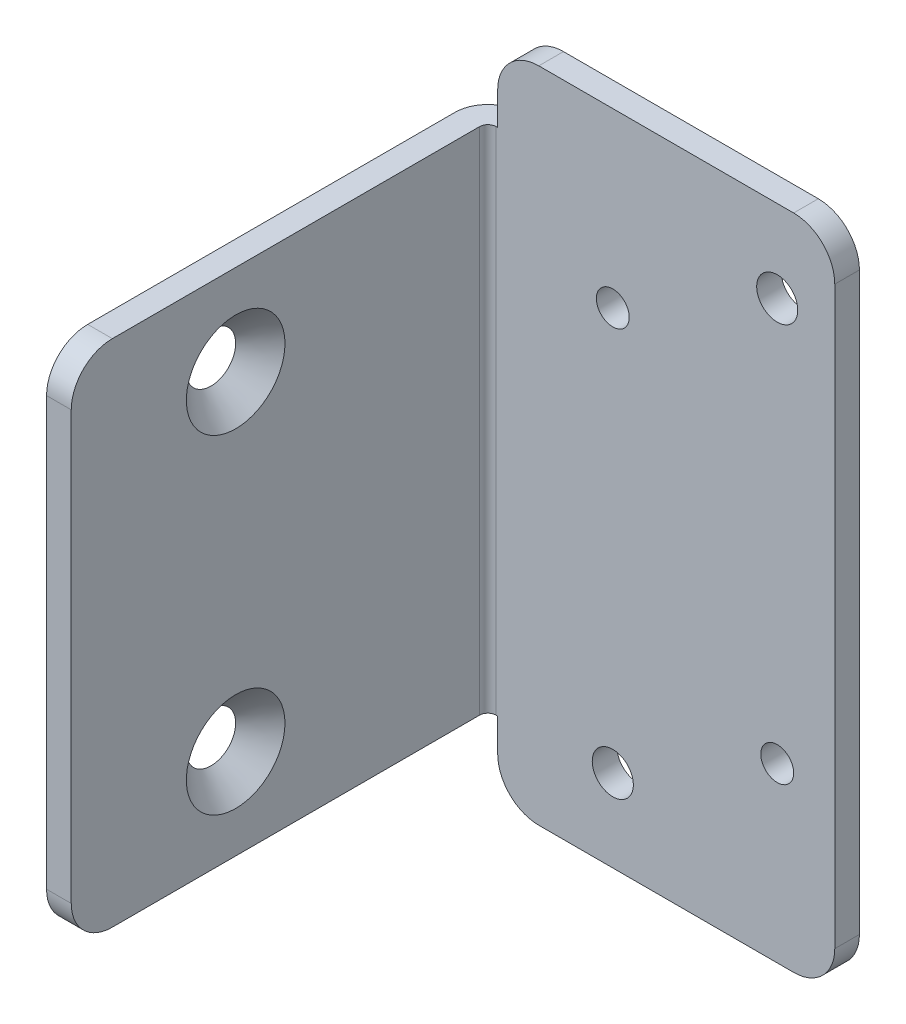
ISO-10303-21;
HEADER;
FILE_DESCRIPTION(('STEP AP214'),'2;1');
FILE_NAME('part.step','',(''),(''),'','','');
FILE_SCHEMA(('AUTOMOTIVE_DESIGN { 1 0 10303 214 1 1 1 1 }'));
ENDSEC;
DATA;
#1=APPLICATION_CONTEXT('core data for automotive mechanical design processes');
#2=APPLICATION_PROTOCOL_DEFINITION('international standard','automotive_design',2000,#1);
#3=PRODUCT_CONTEXT('',#1,'mechanical');
#4=PRODUCT('Part','Part','',(#3));
#5=PRODUCT_RELATED_PRODUCT_CATEGORY('part','',(#4));
#6=PRODUCT_DEFINITION_FORMATION('','',#4);
#7=PRODUCT_DEFINITION_CONTEXT('part definition',#1,'design');
#8=PRODUCT_DEFINITION('design','',#6,#7);
#9=PRODUCT_DEFINITION_SHAPE('','',#8);
#10=(LENGTH_UNIT() NAMED_UNIT(*) SI_UNIT(.MILLI.,.METRE.));
#11=(NAMED_UNIT(*) PLANE_ANGLE_UNIT() SI_UNIT($,.RADIAN.));
#12=(NAMED_UNIT(*) SI_UNIT($,.STERADIAN.) SOLID_ANGLE_UNIT());
#13=UNCERTAINTY_MEASURE_WITH_UNIT(LENGTH_MEASURE(1.E-05),#10,'distance_accuracy_value','');
#14=(GEOMETRIC_REPRESENTATION_CONTEXT(3) GLOBAL_UNCERTAINTY_ASSIGNED_CONTEXT((#13)) GLOBAL_UNIT_ASSIGNED_CONTEXT((#10,
#11,#12)) REPRESENTATION_CONTEXT('',''));
#15=CARTESIAN_POINT('',(0.,0.,0.));
#16=DIRECTION('',(0.,0.,1.));
#17=DIRECTION('',(1.,0.,0.));
#18=AXIS2_PLACEMENT_3D('',#15,#16,#17);
#19=CARTESIAN_POINT('',(-42.2,14.,53.6741153096782));
#20=DIRECTION('',(0.,0.,-1.));
#21=DIRECTION('',(-1.,0.,0.));
#22=AXIS2_PLACEMENT_3D('',#19,#20,#21);
#23=PLANE('',#22);
#24=DIRECTION('',(0.,1.,0.));
#25=VECTOR('',#24,1.);
#26=CARTESIAN_POINT('',(-42.2,75.,53.6741153096782));
#27=LINE('',#26,#25);
#28=CARTESIAN_POINT('',(-42.2,14.,53.6741153096782));
#29=VERTEX_POINT('',#28);
#30=CARTESIAN_POINT('',(-42.2,66.,53.6741153096782));
#31=VERTEX_POINT('',#30);
#32=EDGE_CURVE('E150',#29,#31,#27,.T.);
#33=ORIENTED_EDGE('',*,*,#32,.T.);
#34=DIRECTION('',(-1.,0.,0.));
#35=VECTOR('',#34,1.);
#36=CARTESIAN_POINT('',(-42.2,66.,53.6741153096782));
#37=LINE('',#36,#35);
#38=CARTESIAN_POINT('',(-45.2,66.,53.6741153096782));
#39=VERTEX_POINT('',#38);
#40=EDGE_CURVE('E192',#39,#31,#37,.F.);
#41=ORIENTED_EDGE('',*,*,#40,.F.);
#42=DIRECTION('',(0.,1.,0.));
#43=VECTOR('',#42,1.);
#44=CARTESIAN_POINT('',(-45.2,75.,53.6741153096782));
#45=LINE('',#44,#43);
#46=CARTESIAN_POINT('',(-45.2,14.,53.6741153096782));
#47=VERTEX_POINT('',#46);
#48=EDGE_CURVE('E157',#47,#39,#45,.T.);
#49=ORIENTED_EDGE('',*,*,#48,.F.);
#50=DIRECTION('',(-1.,0.,0.));
#51=VECTOR('',#50,1.);
#52=CARTESIAN_POINT('',(-42.2,14.,53.6741153096782));
#53=LINE('',#52,#51);
#54=EDGE_CURVE('E151',#29,#47,#53,.T.);
#55=ORIENTED_EDGE('',*,*,#54,.F.);
#56=EDGE_LOOP('',(#33,#41,#49,#55));
#57=FACE_BOUND('',#56,.T.);
#58=ADVANCED_FACE('F16',(#57),#23,.F.);
#59=CARTESIAN_POINT('',(-42.2,14.,48.6741153096782));
#60=DIRECTION('',(-1.,0.,0.));
#61=DIRECTION('',(0.,0.,1.));
#62=AXIS2_PLACEMENT_3D('',#59,#60,#61);
#63=CYLINDRICAL_SURFACE('',#62,5.);
#64=CARTESIAN_POINT('',(-45.2,14.,48.6741153096782));
#65=DIRECTION('',(-1.,0.,0.));
#66=DIRECTION('',(0.,0.,1.));
#67=AXIS2_PLACEMENT_3D('',#64,#65,#66);
#68=CIRCLE('',#67,5.);
#69=CARTESIAN_POINT('',(-45.2,9.,48.6741153096782));
#70=VERTEX_POINT('',#69);
#71=EDGE_CURVE('E139',#70,#47,#68,.T.);
#72=ORIENTED_EDGE('',*,*,#71,.F.);
#73=DIRECTION('',(-1.,0.,0.));
#74=VECTOR('',#73,1.);
#75=CARTESIAN_POINT('',(-41.,9.,48.6741153096782));
#76=LINE('',#75,#74);
#77=CARTESIAN_POINT('',(-42.2,9.,48.6741153096782));
#78=VERTEX_POINT('',#77);
#79=EDGE_CURVE('E133',#70,#78,#76,.F.);
#80=ORIENTED_EDGE('',*,*,#79,.T.);
#81=CARTESIAN_POINT('',(-42.2,14.,48.6741153096782));
#82=DIRECTION('',(-1.,0.,0.));
#83=DIRECTION('',(0.,0.,1.));
#84=AXIS2_PLACEMENT_3D('',#81,#82,#83);
#85=CIRCLE('',#84,5.);
#86=EDGE_CURVE('E19',#78,#29,#85,.T.);
#87=ORIENTED_EDGE('',*,*,#86,.T.);
#88=ORIENTED_EDGE('',*,*,#54,.T.);
#89=EDGE_LOOP('',(#72,#80,#87,#88));
#90=FACE_BOUND('',#89,.T.);
#91=ADVANCED_FACE('F135',(#90),#63,.T.);
#92=CARTESIAN_POINT('',(-42.1999999999798,20.,33.6741153096782));
#93=DIRECTION('',(1.,0.,0.));
#94=DIRECTION('',(0.,0.,-1.));
#95=AXIS2_PLACEMENT_3D('',#92,#93,#94);
#96=CONICAL_SURFACE('',#95,6.00000000002724,0.785398163397443);
#97=CARTESIAN_POINT('',(-42.1999999999797,20.,33.6741153096782));
#98=DIRECTION('',(1.,0.,0.));
#99=DIRECTION('',(0.,0.,-1.));
#100=AXIS2_PLACEMENT_3D('',#97,#98,#99);
#101=CIRCLE('',#100,6.00000000002727);
#102=CARTESIAN_POINT('',(-42.1999999999798,20.,27.6741153096509));
#103=VERTEX_POINT('',#102);
#104=EDGE_CURVE('E190',#103,#103,#101,.T.);
#105=ORIENTED_EDGE('',*,*,#104,.T.);
#106=EDGE_LOOP('',(#105));
#107=FACE_BOUND('',#106,.T.);
#108=CARTESIAN_POINT('',(-45.1999999999657,20.,33.6741153096782));
#109=DIRECTION('',(1.,0.,0.));
#110=DIRECTION('',(0.,0.,-1.));
#111=AXIS2_PLACEMENT_3D('',#108,#109,#110);
#112=CIRCLE('',#111,3.00000000004134);
#113=CARTESIAN_POINT('',(-45.1999999999657,20.,30.6741153096368));
#114=VERTEX_POINT('',#113);
#115=EDGE_CURVE('E264',#114,#114,#112,.T.);
#116=ORIENTED_EDGE('',*,*,#115,.F.);
#117=EDGE_LOOP('',(#116));
#118=FACE_BOUND('',#117,.T.);
#119=ADVANCED_FACE('F279',(#107,#118),#96,.F.);
#120=CARTESIAN_POINT('',(-42.1999999999798,60.,33.6741153096782));
#121=DIRECTION('',(1.,0.,0.));
#122=DIRECTION('',(0.,0.,-1.));
#123=AXIS2_PLACEMENT_3D('',#120,#121,#122);
#124=CONICAL_SURFACE('',#123,6.00000000002724,0.785398163397443);
#125=CARTESIAN_POINT('',(-42.1999999999797,60.,33.6741153096782));
#126=DIRECTION('',(1.,0.,0.));
#127=DIRECTION('',(0.,0.,-1.));
#128=AXIS2_PLACEMENT_3D('',#125,#126,#127);
#129=CIRCLE('',#128,6.00000000002727);
#130=CARTESIAN_POINT('',(-42.1999999999798,60.,27.6741153096509));
#131=VERTEX_POINT('',#130);
#132=EDGE_CURVE('E274',#131,#131,#129,.T.);
#133=ORIENTED_EDGE('',*,*,#132,.T.);
#134=EDGE_LOOP('',(#133));
#135=FACE_BOUND('',#134,.T.);
#136=CARTESIAN_POINT('',(-45.1999999999657,60.,33.6741153096782));
#137=DIRECTION('',(1.,0.,0.));
#138=DIRECTION('',(0.,0.,-1.));
#139=AXIS2_PLACEMENT_3D('',#136,#137,#138);
#140=CIRCLE('',#139,3.00000000004134);
#141=CARTESIAN_POINT('',(-45.1999999999657,60.,30.6741153096368));
#142=VERTEX_POINT('',#141);
#143=EDGE_CURVE('E261',#142,#142,#140,.T.);
#144=ORIENTED_EDGE('',*,*,#143,.F.);
#145=EDGE_LOOP('',(#144));
#146=FACE_BOUND('',#145,.T.);
#147=ADVANCED_FACE('F284',(#135,#146),#124,.F.);
#148=CARTESIAN_POINT('',(-42.2,75.,-4.32588469032185));
#149=DIRECTION('',(-1.,0.,0.));
#150=DIRECTION('',(0.,0.,1.));
#151=AXIS2_PLACEMENT_3D('',#148,#149,#150);
#152=PLANE('',#151);
#153=ORIENTED_EDGE('',*,*,#132,.F.);
#154=EDGE_LOOP('',(#153));
#155=FACE_BOUND('',#154,.T.);
#156=ORIENTED_EDGE('',*,*,#104,.F.);
#157=EDGE_LOOP('',(#156));
#158=FACE_BOUND('',#157,.T.);
#159=CARTESIAN_POINT('',(-42.2,66.,48.6741153096782));
#160=DIRECTION('',(-1.,0.,0.));
#161=DIRECTION('',(0.,0.,1.));
#162=AXIS2_PLACEMENT_3D('',#159,#160,#161);
#163=CIRCLE('',#162,5.);
#164=CARTESIAN_POINT('',(-42.2000000072099,71.,48.6741153096782));
#165=VERTEX_POINT('',#164);
#166=EDGE_CURVE('E195',#31,#165,#163,.T.);
#167=ORIENTED_EDGE('',*,*,#166,.F.);
#168=ORIENTED_EDGE('',*,*,#32,.F.);
#169=ORIENTED_EDGE('',*,*,#86,.F.);
#170=DIRECTION('',(0.,0.,1.));
#171=VECTOR('',#170,1.);
#172=CARTESIAN_POINT('',(-42.2,9.,3.));
#173=LINE('',#172,#171);
#174=CARTESIAN_POINT('',(-42.2000000144198,9.,4.));
#175=VERTEX_POINT('',#174);
#176=EDGE_CURVE('E143',#78,#175,#173,.F.);
#177=ORIENTED_EDGE('',*,*,#176,.T.);
#178=DIRECTION('',(0.,-1.,0.));
#179=VECTOR('',#178,1.);
#180=CARTESIAN_POINT('',(-42.2000000288397,102.151195926524,4.));
#181=LINE('',#180,#179);
#182=CARTESIAN_POINT('',(-42.2000000216298,71.,4.));
#183=VERTEX_POINT('',#182);
#184=EDGE_CURVE('E163',#175,#183,#181,.F.);
#185=ORIENTED_EDGE('',*,*,#184,.T.);
#186=DIRECTION('',(0.,0.,-1.));
#187=VECTOR('',#186,1.);
#188=CARTESIAN_POINT('',(-42.2000000144198,71.,3.));
#189=LINE('',#188,#187);
#190=EDGE_CURVE('E188',#183,#165,#189,.F.);
#191=ORIENTED_EDGE('',*,*,#190,.T.);
#192=EDGE_LOOP('',(#167,#168,#169,#177,#185,#191));
#193=FACE_BOUND('',#192,.T.);
#194=ADVANCED_FACE('F148',(#155,#158,#193),#152,.F.);
#195=CARTESIAN_POINT('',(-42.2,66.,48.6741153096782));
#196=DIRECTION('',(-1.,0.,0.));
#197=DIRECTION('',(0.,0.,1.));
#198=AXIS2_PLACEMENT_3D('',#195,#196,#197);
#199=CYLINDRICAL_SURFACE('',#198,5.);
#200=CARTESIAN_POINT('',(-45.2,66.,48.6741153096782));
#201=DIRECTION('',(-1.,0.,0.));
#202=DIRECTION('',(0.,0.,1.));
#203=AXIS2_PLACEMENT_3D('',#200,#201,#202);
#204=CIRCLE('',#203,5.);
#205=CARTESIAN_POINT('',(-45.2,71.,48.6741153096782));
#206=VERTEX_POINT('',#205);
#207=EDGE_CURVE('E269',#39,#206,#204,.T.);
#208=ORIENTED_EDGE('',*,*,#207,.F.);
#209=ORIENTED_EDGE('',*,*,#40,.T.);
#210=ORIENTED_EDGE('',*,*,#166,.T.);
#211=DIRECTION('',(1.,0.,0.));
#212=VECTOR('',#211,1.);
#213=CARTESIAN_POINT('',(-41.,71.,48.6741153096782));
#214=LINE('',#213,#212);
#215=EDGE_CURVE('E185',#165,#206,#214,.F.);
#216=ORIENTED_EDGE('',*,*,#215,.T.);
#217=EDGE_LOOP('',(#208,#209,#210,#216));
#218=FACE_BOUND('',#217,.T.);
#219=ADVANCED_FACE('F283',(#218),#199,.T.);
#220=CARTESIAN_POINT('',(-41.2,102.151195926524,4.));
#221=DIRECTION('',(0.,-1.,0.));
#222=DIRECTION('',(1.,0.,0.));
#223=AXIS2_PLACEMENT_3D('',#220,#221,#222);
#224=CYLINDRICAL_SURFACE('',#223,1.00000002883972);
#225=CARTESIAN_POINT('',(-41.2,71.,4.));
#226=DIRECTION('',(0.,-1.,0.));
#227=DIRECTION('',(1.,0.,0.));
#228=AXIS2_PLACEMENT_3D('',#225,#226,#227);
#229=CIRCLE('',#228,1.00000002883972);
#230=CARTESIAN_POINT('',(-41.2,71.,3.));
#231=VERTEX_POINT('',#230);
#232=EDGE_CURVE('E258',#231,#183,#229,.F.);
#233=ORIENTED_EDGE('',*,*,#232,.T.);
#234=ORIENTED_EDGE('',*,*,#184,.F.);
#235=CARTESIAN_POINT('',(-41.2,9.,4.));
#236=DIRECTION('',(0.,-1.,0.));
#237=DIRECTION('',(1.,0.,0.));
#238=AXIS2_PLACEMENT_3D('',#235,#236,#237);
#239=CIRCLE('',#238,1.00000002883972);
#240=CARTESIAN_POINT('',(-41.2,9.,3.));
#241=VERTEX_POINT('',#240);
#242=EDGE_CURVE('E155',#175,#241,#239,.T.);
#243=ORIENTED_EDGE('',*,*,#242,.T.);
#244=DIRECTION('',(0.,1.,0.));
#245=VECTOR('',#244,1.);
#246=CARTESIAN_POINT('',(-41.2,75.,3.));
#247=LINE('',#246,#245);
#248=EDGE_CURVE('E178',#241,#231,#247,.T.);
#249=ORIENTED_EDGE('',*,*,#248,.T.);
#250=EDGE_LOOP('',(#233,#234,#243,#249));
#251=FACE_BOUND('',#250,.T.);
#252=ADVANCED_FACE('F293',(#251),#224,.F.);
#253=CARTESIAN_POINT('',(-41.,9.,3.));
#254=DIRECTION('',(0.,1.,0.));
#255=DIRECTION('',(-1.,0.,0.));
#256=AXIS2_PLACEMENT_3D('',#253,#254,#255);
#257=PLANE('',#256);
#258=ORIENTED_EDGE('',*,*,#242,.F.);
#259=ORIENTED_EDGE('',*,*,#176,.F.);
#260=ORIENTED_EDGE('',*,*,#79,.F.);
#261=DIRECTION('',(0.,0.,1.));
#262=VECTOR('',#261,1.);
#263=CARTESIAN_POINT('',(-45.2,9.,-4.32588469032183));
#264=LINE('',#263,#262);
#265=CARTESIAN_POINT('',(-45.2000000144198,9.,4.));
#266=VERTEX_POINT('',#265);
#267=EDGE_CURVE('E268',#266,#70,#264,.T.);
#268=ORIENTED_EDGE('',*,*,#267,.F.);
#269=CARTESIAN_POINT('',(-41.2,9.,4.));
#270=DIRECTION('',(0.,-1.,0.));
#271=DIRECTION('',(1.,0.,0.));
#272=AXIS2_PLACEMENT_3D('',#269,#270,#271);
#273=CIRCLE('',#272,4.00000002883971);
#274=CARTESIAN_POINT('',(-41.2,9.,0.));
#275=VERTEX_POINT('',#274);
#276=EDGE_CURVE('E175',#275,#266,#273,.F.);
#277=ORIENTED_EDGE('',*,*,#276,.F.);
#278=DIRECTION('',(-1.,0.,0.));
#279=VECTOR('',#278,1.);
#280=CARTESIAN_POINT('',(-41.,9.,0.));
#281=LINE('',#280,#279);
#282=CARTESIAN_POINT('',(-41.,9.,0.));
#283=VERTEX_POINT('',#282);
#284=EDGE_CURVE('E144',#283,#275,#281,.T.);
#285=ORIENTED_EDGE('',*,*,#284,.F.);
#286=DIRECTION('',(0.,0.,-1.));
#287=VECTOR('',#286,1.);
#288=CARTESIAN_POINT('',(-41.,9.,3.));
#289=LINE('',#288,#287);
#290=CARTESIAN_POINT('',(-41.,9.,3.));
#291=VERTEX_POINT('',#290);
#292=EDGE_CURVE('E249',#283,#291,#289,.F.);
#293=ORIENTED_EDGE('',*,*,#292,.T.);
#294=DIRECTION('',(-1.,0.,0.));
#295=VECTOR('',#294,1.);
#296=CARTESIAN_POINT('',(-36.,9.,3.));
#297=LINE('',#296,#295);
#298=EDGE_CURVE('E176',#291,#241,#297,.T.);
#299=ORIENTED_EDGE('',*,*,#298,.T.);
#300=EDGE_LOOP('',(#258,#259,#260,#268,#277,#285,#293,#299));
#301=FACE_BOUND('',#300,.T.);
#302=ADVANCED_FACE('F153',(#301),#257,.F.);
#303=CARTESIAN_POINT('',(-45.2,75.,-4.32588469032183));
#304=DIRECTION('',(-1.,0.,0.));
#305=DIRECTION('',(0.,0.,1.));
#306=AXIS2_PLACEMENT_3D('',#303,#304,#305);
#307=PLANE('',#306);
#308=ORIENTED_EDGE('',*,*,#143,.T.);
#309=EDGE_LOOP('',(#308));
#310=FACE_BOUND('',#309,.T.);
#311=ORIENTED_EDGE('',*,*,#115,.T.);
#312=EDGE_LOOP('',(#311));
#313=FACE_BOUND('',#312,.T.);
#314=ORIENTED_EDGE('',*,*,#267,.T.);
#315=ORIENTED_EDGE('',*,*,#71,.T.);
#316=ORIENTED_EDGE('',*,*,#48,.T.);
#317=ORIENTED_EDGE('',*,*,#207,.T.);
#318=DIRECTION('',(0.,0.,-1.));
#319=VECTOR('',#318,1.);
#320=CARTESIAN_POINT('',(-45.2,71.,3.));
#321=LINE('',#320,#319);
#322=CARTESIAN_POINT('',(-45.2000000144198,71.,4.));
#323=VERTEX_POINT('',#322);
#324=EDGE_CURVE('E187',#206,#323,#321,.T.);
#325=ORIENTED_EDGE('',*,*,#324,.T.);
#326=DIRECTION('',(0.,-1.,0.));
#327=VECTOR('',#326,1.);
#328=CARTESIAN_POINT('',(-45.2000000288397,102.151195926524,4.));
#329=LINE('',#328,#327);
#330=EDGE_CURVE('E171',#266,#323,#329,.F.);
#331=ORIENTED_EDGE('',*,*,#330,.F.);
#332=EDGE_LOOP('',(#314,#315,#316,#317,#325,#331));
#333=FACE_BOUND('',#332,.T.);
#334=ADVANCED_FACE('F371',(#310,#313,#333),#307,.T.);
#335=CARTESIAN_POINT('',(-41.,71.,3.));
#336=DIRECTION('',(0.,-1.,0.));
#337=DIRECTION('',(0.,0.,-1.));
#338=AXIS2_PLACEMENT_3D('',#335,#336,#337);
#339=PLANE('',#338);
#340=CARTESIAN_POINT('',(-41.2,71.,4.));
#341=DIRECTION('',(0.,-1.,0.));
#342=DIRECTION('',(1.,0.,0.));
#343=AXIS2_PLACEMENT_3D('',#340,#341,#342);
#344=CIRCLE('',#343,4.00000002883971);
#345=CARTESIAN_POINT('',(-41.2,71.,-7.20992796715558E-09));
#346=VERTEX_POINT('',#345);
#347=EDGE_CURVE('E242',#323,#346,#344,.T.);
#348=ORIENTED_EDGE('',*,*,#347,.F.);
#349=ORIENTED_EDGE('',*,*,#324,.F.);
#350=ORIENTED_EDGE('',*,*,#215,.F.);
#351=ORIENTED_EDGE('',*,*,#190,.F.);
#352=ORIENTED_EDGE('',*,*,#232,.F.);
#353=DIRECTION('',(-1.,0.,0.));
#354=VECTOR('',#353,1.);
#355=CARTESIAN_POINT('',(-36.,71.,3.));
#356=LINE('',#355,#354);
#357=CARTESIAN_POINT('',(-41.,71.,3.));
#358=VERTEX_POINT('',#357);
#359=EDGE_CURVE('E179',#231,#358,#356,.F.);
#360=ORIENTED_EDGE('',*,*,#359,.T.);
#361=DIRECTION('',(0.,0.,-1.));
#362=VECTOR('',#361,1.);
#363=CARTESIAN_POINT('',(-41.,71.,3.));
#364=LINE('',#363,#362);
#365=CARTESIAN_POINT('',(-41.,71.,-4.80661878933068E-09));
#366=VERTEX_POINT('',#365);
#367=EDGE_CURVE('E239',#358,#366,#364,.T.);
#368=ORIENTED_EDGE('',*,*,#367,.T.);
#369=DIRECTION('',(1.,0.,0.));
#370=VECTOR('',#369,1.);
#371=CARTESIAN_POINT('',(-41.,71.,-1.4419856367992E-08));
#372=LINE('',#371,#370);
#373=EDGE_CURVE('E395',#346,#366,#372,.T.);
#374=ORIENTED_EDGE('',*,*,#373,.F.);
#375=EDGE_LOOP('',(#348,#349,#350,#351,#352,#360,#368,#374));
#376=FACE_BOUND('',#375,.T.);
#377=ADVANCED_FACE('F367',(#376),#339,.F.);
#378=CARTESIAN_POINT('',(-36.,75.,3.));
#379=DIRECTION('',(0.,0.,-1.));
#380=DIRECTION('',(-1.,0.,0.));
#381=AXIS2_PLACEMENT_3D('',#378,#379,#380);
#382=PLANE('',#381);
#383=CARTESIAN_POINT('',(-27.,59.,3.));
#384=DIRECTION('',(0.,0.,-1.));
#385=DIRECTION('',(-1.,0.,0.));
#386=AXIS2_PLACEMENT_3D('',#383,#384,#385);
#387=CIRCLE('',#386,2.);
#388=CARTESIAN_POINT('',(-29.,59.,3.));
#389=VERTEX_POINT('',#388);
#390=EDGE_CURVE('E184',#389,#389,#387,.T.);
#391=ORIENTED_EDGE('',*,*,#390,.T.);
#392=EDGE_LOOP('',(#391));
#393=FACE_BOUND('',#392,.T.);
#394=CARTESIAN_POINT('',(-7.,21.,3.));
#395=DIRECTION('',(0.,0.,-1.));
#396=DIRECTION('',(-1.,0.,0.));
#397=AXIS2_PLACEMENT_3D('',#394,#395,#396);
#398=CIRCLE('',#397,2.);
#399=CARTESIAN_POINT('',(-9.,21.,3.));
#400=VERTEX_POINT('',#399);
#401=EDGE_CURVE('E253',#400,#400,#398,.T.);
#402=ORIENTED_EDGE('',*,*,#401,.T.);
#403=EDGE_LOOP('',(#402));
#404=FACE_BOUND('',#403,.T.);
#405=CARTESIAN_POINT('',(-7.,70.,3.));
#406=DIRECTION('',(0.,0.,-1.));
#407=DIRECTION('',(-1.,0.,0.));
#408=AXIS2_PLACEMENT_3D('',#405,#406,#407);
#409=CIRCLE('',#408,2.5);
#410=CARTESIAN_POINT('',(-9.5,70.,3.));
#411=VERTEX_POINT('',#410);
#412=EDGE_CURVE('E250',#411,#411,#409,.T.);
#413=ORIENTED_EDGE('',*,*,#412,.T.);
#414=EDGE_LOOP('',(#413));
#415=FACE_BOUND('',#414,.T.);
#416=CARTESIAN_POINT('',(-27.,10.,3.));
#417=DIRECTION('',(0.,0.,-1.));
#418=DIRECTION('',(-1.,0.,0.));
#419=AXIS2_PLACEMENT_3D('',#416,#417,#418);
#420=CIRCLE('',#419,2.5);
#421=CARTESIAN_POINT('',(-29.5,10.,3.));
#422=VERTEX_POINT('',#421);
#423=EDGE_CURVE('E246',#422,#422,#420,.T.);
#424=ORIENTED_EDGE('',*,*,#423,.T.);
#425=EDGE_LOOP('',(#424));
#426=FACE_BOUND('',#425,.T.);
#427=ORIENTED_EDGE('',*,*,#298,.F.);
#428=DIRECTION('',(0.,1.,0.));
#429=VECTOR('',#428,1.);
#430=CARTESIAN_POINT('',(-41.,5.,3.));
#431=LINE('',#430,#429);
#432=CARTESIAN_POINT('',(-41.,5.,3.));
#433=VERTEX_POINT('',#432);
#434=EDGE_CURVE('E245',#291,#433,#431,.F.);
#435=ORIENTED_EDGE('',*,*,#434,.T.);
#436=CARTESIAN_POINT('',(-36.,5.,3.));
#437=DIRECTION('',(0.,0.,-1.));
#438=DIRECTION('',(-1.,0.,0.));
#439=AXIS2_PLACEMENT_3D('',#436,#437,#438);
#440=CIRCLE('',#439,5.);
#441=CARTESIAN_POINT('',(-36.,0.,3.));
#442=VERTEX_POINT('',#441);
#443=EDGE_CURVE('E220',#442,#433,#440,.T.);
#444=ORIENTED_EDGE('',*,*,#443,.F.);
#445=DIRECTION('',(-1.,0.,0.));
#446=VECTOR('',#445,1.);
#447=CARTESIAN_POINT('',(-5.,0.,3.));
#448=LINE('',#447,#446);
#449=CARTESIAN_POINT('',(-5.,0.,3.));
#450=VERTEX_POINT('',#449);
#451=EDGE_CURVE('E421',#442,#450,#448,.F.);
#452=ORIENTED_EDGE('',*,*,#451,.T.);
#453=CARTESIAN_POINT('',(-5.,5.,3.));
#454=DIRECTION('',(0.,0.,-1.));
#455=DIRECTION('',(-1.,0.,0.));
#456=AXIS2_PLACEMENT_3D('',#453,#454,#455);
#457=CIRCLE('',#456,5.);
#458=CARTESIAN_POINT('',(0.,5.,3.));
#459=VERTEX_POINT('',#458);
#460=EDGE_CURVE('E225',#459,#450,#457,.T.);
#461=ORIENTED_EDGE('',*,*,#460,.F.);
#462=DIRECTION('',(0.,1.,0.));
#463=VECTOR('',#462,1.);
#464=CARTESIAN_POINT('',(0.,5.,3.));
#465=LINE('',#464,#463);
#466=CARTESIAN_POINT('',(0.,75.,3.));
#467=VERTEX_POINT('',#466);
#468=EDGE_CURVE('E425',#459,#467,#465,.T.);
#469=ORIENTED_EDGE('',*,*,#468,.T.);
#470=CARTESIAN_POINT('',(-5.,75.,3.));
#471=DIRECTION('',(0.,0.,-1.));
#472=DIRECTION('',(-1.,0.,0.));
#473=AXIS2_PLACEMENT_3D('',#470,#471,#472);
#474=CIRCLE('',#473,5.);
#475=CARTESIAN_POINT('',(-5.,80.,3.));
#476=VERTEX_POINT('',#475);
#477=EDGE_CURVE('E230',#476,#467,#474,.T.);
#478=ORIENTED_EDGE('',*,*,#477,.F.);
#479=DIRECTION('',(1.,0.,0.));
#480=VECTOR('',#479,1.);
#481=CARTESIAN_POINT('',(-5.,80.,3.));
#482=LINE('',#481,#480);
#483=CARTESIAN_POINT('',(-36.,80.,3.));
#484=VERTEX_POINT('',#483);
#485=EDGE_CURVE('E429',#476,#484,#482,.F.);
#486=ORIENTED_EDGE('',*,*,#485,.T.);
#487=CARTESIAN_POINT('',(-36.,75.,3.));
#488=DIRECTION('',(0.,0.,-1.));
#489=DIRECTION('',(-1.,0.,0.));
#490=AXIS2_PLACEMENT_3D('',#487,#488,#489);
#491=CIRCLE('',#490,5.);
#492=CARTESIAN_POINT('',(-41.,75.,3.));
#493=VERTEX_POINT('',#492);
#494=EDGE_CURVE('E235',#493,#484,#491,.T.);
#495=ORIENTED_EDGE('',*,*,#494,.F.);
#496=DIRECTION('',(0.,1.,0.));
#497=VECTOR('',#496,1.);
#498=CARTESIAN_POINT('',(-41.,71.,3.));
#499=LINE('',#498,#497);
#500=EDGE_CURVE('E174',#493,#358,#499,.F.);
#501=ORIENTED_EDGE('',*,*,#500,.T.);
#502=ORIENTED_EDGE('',*,*,#359,.F.);
#503=ORIENTED_EDGE('',*,*,#248,.F.);
#504=EDGE_LOOP('',(#427,#435,#444,#452,#461,#469,#478,#486,#495,#501,#502,#503));
#505=FACE_BOUND('',#504,.T.);
#506=ADVANCED_FACE('F363',(#393,#404,#415,#426,#505),#382,.F.);
#507=CARTESIAN_POINT('',(-27.,59.,3.));
#508=DIRECTION('',(0.,0.,-1.));
#509=DIRECTION('',(-1.,0.,0.));
#510=AXIS2_PLACEMENT_3D('',#507,#508,#509);
#511=CYLINDRICAL_SURFACE('',#510,2.);
#512=ORIENTED_EDGE('',*,*,#390,.F.);
#513=EDGE_LOOP('',(#512));
#514=FACE_BOUND('',#513,.T.);
#515=CARTESIAN_POINT('',(-27.,59.,0.));
#516=DIRECTION('',(0.,0.,-1.));
#517=DIRECTION('',(-1.,0.,0.));
#518=AXIS2_PLACEMENT_3D('',#515,#516,#517);
#519=CIRCLE('',#518,2.);
#520=CARTESIAN_POINT('',(-29.,59.,0.));
#521=VERTEX_POINT('',#520);
#522=EDGE_CURVE('E217',#521,#521,#519,.F.);
#523=ORIENTED_EDGE('',*,*,#522,.F.);
#524=EDGE_LOOP('',(#523));
#525=FACE_BOUND('',#524,.T.);
#526=ADVANCED_FACE('F359',(#514,#525),#511,.F.);
#527=CARTESIAN_POINT('',(-7.,21.,3.));
#528=DIRECTION('',(0.,0.,-1.));
#529=DIRECTION('',(-1.,0.,0.));
#530=AXIS2_PLACEMENT_3D('',#527,#528,#529);
#531=CYLINDRICAL_SURFACE('',#530,2.);
#532=ORIENTED_EDGE('',*,*,#401,.F.);
#533=EDGE_LOOP('',(#532));
#534=FACE_BOUND('',#533,.T.);
#535=CARTESIAN_POINT('',(-7.,21.,0.));
#536=DIRECTION('',(0.,0.,-1.));
#537=DIRECTION('',(-1.,0.,0.));
#538=AXIS2_PLACEMENT_3D('',#535,#536,#537);
#539=CIRCLE('',#538,2.);
#540=CARTESIAN_POINT('',(-9.,21.,0.));
#541=VERTEX_POINT('',#540);
#542=EDGE_CURVE('E214',#541,#541,#539,.F.);
#543=ORIENTED_EDGE('',*,*,#542,.F.);
#544=EDGE_LOOP('',(#543));
#545=FACE_BOUND('',#544,.T.);
#546=ADVANCED_FACE('F355',(#534,#545),#531,.F.);
#547=CARTESIAN_POINT('',(-7.,70.,3.));
#548=DIRECTION('',(0.,0.,-1.));
#549=DIRECTION('',(-1.,0.,0.));
#550=AXIS2_PLACEMENT_3D('',#547,#548,#549);
#551=CYLINDRICAL_SURFACE('',#550,2.5);
#552=ORIENTED_EDGE('',*,*,#412,.F.);
#553=EDGE_LOOP('',(#552));
#554=FACE_BOUND('',#553,.T.);
#555=CARTESIAN_POINT('',(-7.,70.,0.));
#556=DIRECTION('',(0.,0.,-1.));
#557=DIRECTION('',(-1.,0.,0.));
#558=AXIS2_PLACEMENT_3D('',#555,#556,#557);
#559=CIRCLE('',#558,2.5);
#560=CARTESIAN_POINT('',(-9.5,70.,0.));
#561=VERTEX_POINT('',#560);
#562=EDGE_CURVE('E211',#561,#561,#559,.F.);
#563=ORIENTED_EDGE('',*,*,#562,.F.);
#564=EDGE_LOOP('',(#563));
#565=FACE_BOUND('',#564,.T.);
#566=ADVANCED_FACE('F351',(#554,#565),#551,.F.);
#567=CARTESIAN_POINT('',(-27.,10.,3.));
#568=DIRECTION('',(0.,0.,-1.));
#569=DIRECTION('',(-1.,0.,0.));
#570=AXIS2_PLACEMENT_3D('',#567,#568,#569);
#571=CYLINDRICAL_SURFACE('',#570,2.5);
#572=ORIENTED_EDGE('',*,*,#423,.F.);
#573=EDGE_LOOP('',(#572));
#574=FACE_BOUND('',#573,.T.);
#575=CARTESIAN_POINT('',(-27.,10.,0.));
#576=DIRECTION('',(0.,0.,-1.));
#577=DIRECTION('',(-1.,0.,0.));
#578=AXIS2_PLACEMENT_3D('',#575,#576,#577);
#579=CIRCLE('',#578,2.5);
#580=CARTESIAN_POINT('',(-29.5,10.,0.));
#581=VERTEX_POINT('',#580);
#582=EDGE_CURVE('E208',#581,#581,#579,.F.);
#583=ORIENTED_EDGE('',*,*,#582,.F.);
#584=EDGE_LOOP('',(#583));
#585=FACE_BOUND('',#584,.T.);
#586=ADVANCED_FACE('F347',(#574,#585),#571,.F.);
#587=CARTESIAN_POINT('',(-41.,5.,3.));
#588=DIRECTION('',(1.,0.,0.));
#589=DIRECTION('',(0.,0.,-1.));
#590=AXIS2_PLACEMENT_3D('',#587,#588,#589);
#591=PLANE('',#590);
#592=ORIENTED_EDGE('',*,*,#434,.F.);
#593=ORIENTED_EDGE('',*,*,#292,.F.);
#594=DIRECTION('',(0.,1.,0.));
#595=VECTOR('',#594,1.);
#596=CARTESIAN_POINT('',(-41.,75.,0.));
#597=LINE('',#596,#595);
#598=CARTESIAN_POINT('',(-41.,5.,0.));
#599=VERTEX_POINT('',#598);
#600=EDGE_CURVE('E170',#599,#283,#597,.T.);
#601=ORIENTED_EDGE('',*,*,#600,.F.);
#602=DIRECTION('',(0.,0.,-1.));
#603=VECTOR('',#602,1.);
#604=CARTESIAN_POINT('',(-41.,5.,3.));
#605=LINE('',#604,#603);
#606=EDGE_CURVE('E223',#433,#599,#605,.T.);
#607=ORIENTED_EDGE('',*,*,#606,.F.);
#608=EDGE_LOOP('',(#592,#593,#601,#607));
#609=FACE_BOUND('',#608,.T.);
#610=ADVANCED_FACE('F343',(#609),#591,.F.);
#611=CARTESIAN_POINT('',(-41.2,102.151195926524,4.));
#612=DIRECTION('',(0.,-1.,0.));
#613=DIRECTION('',(1.,0.,0.));
#614=AXIS2_PLACEMENT_3D('',#611,#612,#613);
#615=CYLINDRICAL_SURFACE('',#614,4.00000002883971);
#616=ORIENTED_EDGE('',*,*,#276,.T.);
#617=ORIENTED_EDGE('',*,*,#330,.T.);
#618=ORIENTED_EDGE('',*,*,#347,.T.);
#619=DIRECTION('',(0.,1.,0.));
#620=VECTOR('',#619,1.);
#621=CARTESIAN_POINT('',(-41.2,75.,0.));
#622=LINE('',#621,#620);
#623=EDGE_CURVE('E166',#275,#346,#622,.T.);
#624=ORIENTED_EDGE('',*,*,#623,.F.);
#625=EDGE_LOOP('',(#616,#617,#618,#624));
#626=FACE_BOUND('',#625,.T.);
#627=ADVANCED_FACE('F339',(#626),#615,.T.);
#628=CARTESIAN_POINT('',(-41.,71.,3.));
#629=DIRECTION('',(1.,0.,0.));
#630=DIRECTION('',(0.,0.,-1.));
#631=AXIS2_PLACEMENT_3D('',#628,#629,#630);
#632=PLANE('',#631);
#633=ORIENTED_EDGE('',*,*,#500,.F.);
#634=DIRECTION('',(0.,0.,-1.));
#635=VECTOR('',#634,1.);
#636=CARTESIAN_POINT('',(-41.,75.,3.));
#637=LINE('',#636,#635);
#638=CARTESIAN_POINT('',(-41.,75.,0.));
#639=VERTEX_POINT('',#638);
#640=EDGE_CURVE('E238',#639,#493,#637,.F.);
#641=ORIENTED_EDGE('',*,*,#640,.F.);
#642=DIRECTION('',(0.,1.,0.));
#643=VECTOR('',#642,1.);
#644=CARTESIAN_POINT('',(-41.,75.,0.));
#645=LINE('',#644,#643);
#646=EDGE_CURVE('E169',#366,#639,#645,.T.);
#647=ORIENTED_EDGE('',*,*,#646,.F.);
#648=ORIENTED_EDGE('',*,*,#367,.F.);
#649=EDGE_LOOP('',(#633,#641,#647,#648));
#650=FACE_BOUND('',#649,.T.);
#651=ADVANCED_FACE('F335',(#650),#632,.F.);
#652=CARTESIAN_POINT('',(-36.,75.,3.));
#653=DIRECTION('',(0.,0.,-1.));
#654=DIRECTION('',(-1.,0.,0.));
#655=AXIS2_PLACEMENT_3D('',#652,#653,#654);
#656=CYLINDRICAL_SURFACE('',#655,5.);
#657=CARTESIAN_POINT('',(-36.,75.,0.));
#658=DIRECTION('',(0.,0.,-1.));
#659=DIRECTION('',(-1.,0.,0.));
#660=AXIS2_PLACEMENT_3D('',#657,#658,#659);
#661=CIRCLE('',#660,5.);
#662=CARTESIAN_POINT('',(-36.,80.,0.));
#663=VERTEX_POINT('',#662);
#664=EDGE_CURVE('E205',#639,#663,#661,.T.);
#665=ORIENTED_EDGE('',*,*,#664,.F.);
#666=ORIENTED_EDGE('',*,*,#640,.T.);
#667=ORIENTED_EDGE('',*,*,#494,.T.);
#668=DIRECTION('',(0.,0.,1.));
#669=VECTOR('',#668,1.);
#670=CARTESIAN_POINT('',(-36.,80.,3.));
#671=LINE('',#670,#669);
#672=EDGE_CURVE('E234',#484,#663,#671,.F.);
#673=ORIENTED_EDGE('',*,*,#672,.T.);
#674=EDGE_LOOP('',(#665,#666,#667,#673));
#675=FACE_BOUND('',#674,.T.);
#676=ADVANCED_FACE('F331',(#675),#656,.T.);
#677=CARTESIAN_POINT('',(-5.,80.,3.));
#678=DIRECTION('',(0.,-1.,0.));
#679=DIRECTION('',(1.,0.,0.));
#680=AXIS2_PLACEMENT_3D('',#677,#678,#679);
#681=PLANE('',#680);
#682=ORIENTED_EDGE('',*,*,#485,.F.);
#683=DIRECTION('',(0.,0.,-1.));
#684=VECTOR('',#683,1.);
#685=CARTESIAN_POINT('',(-5.,80.,3.));
#686=LINE('',#685,#684);
#687=CARTESIAN_POINT('',(-5.,80.,0.));
#688=VERTEX_POINT('',#687);
#689=EDGE_CURVE('E233',#688,#476,#686,.F.);
#690=ORIENTED_EDGE('',*,*,#689,.F.);
#691=DIRECTION('',(-1.,0.,0.));
#692=VECTOR('',#691,1.);
#693=CARTESIAN_POINT('',(-36.,80.,0.));
#694=LINE('',#693,#692);
#695=EDGE_CURVE('E204',#663,#688,#694,.F.);
#696=ORIENTED_EDGE('',*,*,#695,.F.);
#697=ORIENTED_EDGE('',*,*,#672,.F.);
#698=EDGE_LOOP('',(#682,#690,#696,#697));
#699=FACE_BOUND('',#698,.T.);
#700=ADVANCED_FACE('F327',(#699),#681,.F.);
#701=CARTESIAN_POINT('',(-5.,75.,3.));
#702=DIRECTION('',(0.,0.,-1.));
#703=DIRECTION('',(-1.,0.,0.));
#704=AXIS2_PLACEMENT_3D('',#701,#702,#703);
#705=CYLINDRICAL_SURFACE('',#704,5.);
#706=CARTESIAN_POINT('',(-5.,75.,0.));
#707=DIRECTION('',(0.,0.,-1.));
#708=DIRECTION('',(-1.,0.,0.));
#709=AXIS2_PLACEMENT_3D('',#706,#707,#708);
#710=CIRCLE('',#709,5.);
#711=CARTESIAN_POINT('',(0.,75.,0.));
#712=VERTEX_POINT('',#711);
#713=EDGE_CURVE('E201',#688,#712,#710,.T.);
#714=ORIENTED_EDGE('',*,*,#713,.F.);
#715=ORIENTED_EDGE('',*,*,#689,.T.);
#716=ORIENTED_EDGE('',*,*,#477,.T.);
#717=DIRECTION('',(0.,0.,1.));
#718=VECTOR('',#717,1.);
#719=CARTESIAN_POINT('',(0.,75.,3.));
#720=LINE('',#719,#718);
#721=EDGE_CURVE('E229',#467,#712,#720,.F.);
#722=ORIENTED_EDGE('',*,*,#721,.T.);
#723=EDGE_LOOP('',(#714,#715,#716,#722));
#724=FACE_BOUND('',#723,.T.);
#725=ADVANCED_FACE('F323',(#724),#705,.T.);
#726=CARTESIAN_POINT('',(0.,5.,3.));
#727=DIRECTION('',(-1.,0.,0.));
#728=DIRECTION('',(0.,0.,1.));
#729=AXIS2_PLACEMENT_3D('',#726,#727,#728);
#730=PLANE('',#729);
#731=ORIENTED_EDGE('',*,*,#468,.F.);
#732=DIRECTION('',(0.,0.,-1.));
#733=VECTOR('',#732,1.);
#734=CARTESIAN_POINT('',(0.,5.,3.));
#735=LINE('',#734,#733);
#736=CARTESIAN_POINT('',(0.,5.,0.));
#737=VERTEX_POINT('',#736);
#738=EDGE_CURVE('E228',#737,#459,#735,.F.);
#739=ORIENTED_EDGE('',*,*,#738,.F.);
#740=DIRECTION('',(0.,1.,0.));
#741=VECTOR('',#740,1.);
#742=CARTESIAN_POINT('',(0.,75.,0.));
#743=LINE('',#742,#741);
#744=EDGE_CURVE('E200',#712,#737,#743,.F.);
#745=ORIENTED_EDGE('',*,*,#744,.F.);
#746=ORIENTED_EDGE('',*,*,#721,.F.);
#747=EDGE_LOOP('',(#731,#739,#745,#746));
#748=FACE_BOUND('',#747,.T.);
#749=ADVANCED_FACE('F319',(#748),#730,.F.);
#750=CARTESIAN_POINT('',(-5.,5.,3.));
#751=DIRECTION('',(0.,0.,-1.));
#752=DIRECTION('',(-1.,0.,0.));
#753=AXIS2_PLACEMENT_3D('',#750,#751,#752);
#754=CYLINDRICAL_SURFACE('',#753,5.);
#755=CARTESIAN_POINT('',(-5.,5.,0.));
#756=DIRECTION('',(0.,0.,-1.));
#757=DIRECTION('',(-1.,0.,0.));
#758=AXIS2_PLACEMENT_3D('',#755,#756,#757);
#759=CIRCLE('',#758,5.);
#760=CARTESIAN_POINT('',(-5.,0.,0.));
#761=VERTEX_POINT('',#760);
#762=EDGE_CURVE('E197',#737,#761,#759,.T.);
#763=ORIENTED_EDGE('',*,*,#762,.F.);
#764=ORIENTED_EDGE('',*,*,#738,.T.);
#765=ORIENTED_EDGE('',*,*,#460,.T.);
#766=DIRECTION('',(0.,0.,1.));
#767=VECTOR('',#766,1.);
#768=CARTESIAN_POINT('',(-5.,0.,3.));
#769=LINE('',#768,#767);
#770=EDGE_CURVE('E224',#450,#761,#769,.F.);
#771=ORIENTED_EDGE('',*,*,#770,.T.);
#772=EDGE_LOOP('',(#763,#764,#765,#771));
#773=FACE_BOUND('',#772,.T.);
#774=ADVANCED_FACE('F316',(#773),#754,.T.);
#775=CARTESIAN_POINT('',(-5.,0.,3.));
#776=DIRECTION('',(0.,1.,0.));
#777=DIRECTION('',(-1.,0.,0.));
#778=AXIS2_PLACEMENT_3D('',#775,#776,#777);
#779=PLANE('',#778);
#780=ORIENTED_EDGE('',*,*,#451,.F.);
#781=DIRECTION('',(0.,0.,-1.));
#782=VECTOR('',#781,1.);
#783=CARTESIAN_POINT('',(-36.,0.,3.));
#784=LINE('',#783,#782);
#785=CARTESIAN_POINT('',(-36.,0.,0.));
#786=VERTEX_POINT('',#785);
#787=EDGE_CURVE('E34',#786,#442,#784,.F.);
#788=ORIENTED_EDGE('',*,*,#787,.F.);
#789=DIRECTION('',(-1.,0.,0.));
#790=VECTOR('',#789,1.);
#791=CARTESIAN_POINT('',(-36.,0.,0.));
#792=LINE('',#791,#790);
#793=EDGE_CURVE('E25',#761,#786,#792,.T.);
#794=ORIENTED_EDGE('',*,*,#793,.F.);
#795=ORIENTED_EDGE('',*,*,#770,.F.);
#796=EDGE_LOOP('',(#780,#788,#794,#795));
#797=FACE_BOUND('',#796,.T.);
#798=ADVANCED_FACE('F308',(#797),#779,.F.);
#799=CARTESIAN_POINT('',(-36.,5.,3.));
#800=DIRECTION('',(0.,0.,-1.));
#801=DIRECTION('',(-1.,0.,0.));
#802=AXIS2_PLACEMENT_3D('',#799,#800,#801);
#803=CYLINDRICAL_SURFACE('',#802,5.);
#804=CARTESIAN_POINT('',(-36.,5.,0.));
#805=DIRECTION('',(0.,0.,-1.));
#806=DIRECTION('',(-1.,0.,0.));
#807=AXIS2_PLACEMENT_3D('',#804,#805,#806);
#808=CIRCLE('',#807,5.);
#809=EDGE_CURVE('E10',#786,#599,#808,.T.);
#810=ORIENTED_EDGE('',*,*,#809,.F.);
#811=ORIENTED_EDGE('',*,*,#787,.T.);
#812=ORIENTED_EDGE('',*,*,#443,.T.);
#813=ORIENTED_EDGE('',*,*,#606,.T.);
#814=EDGE_LOOP('',(#810,#811,#812,#813));
#815=FACE_BOUND('',#814,.T.);
#816=ADVANCED_FACE('F301',(#815),#803,.T.);
#817=CARTESIAN_POINT('',(-36.,75.,0.));
#818=DIRECTION('',(0.,0.,-1.));
#819=DIRECTION('',(-1.,0.,0.));
#820=AXIS2_PLACEMENT_3D('',#817,#818,#819);
#821=PLANE('',#820);
#822=ORIENTED_EDGE('',*,*,#793,.T.);
#823=ORIENTED_EDGE('',*,*,#809,.T.);
#824=ORIENTED_EDGE('',*,*,#600,.T.);
#825=ORIENTED_EDGE('',*,*,#284,.T.);
#826=ORIENTED_EDGE('',*,*,#623,.T.);
#827=ORIENTED_EDGE('',*,*,#373,.T.);
#828=ORIENTED_EDGE('',*,*,#646,.T.);
#829=ORIENTED_EDGE('',*,*,#664,.T.);
#830=ORIENTED_EDGE('',*,*,#695,.T.);
#831=ORIENTED_EDGE('',*,*,#713,.T.);
#832=ORIENTED_EDGE('',*,*,#744,.T.);
#833=ORIENTED_EDGE('',*,*,#762,.T.);
#834=EDGE_LOOP('',(#822,#823,#824,#825,#826,#827,#828,#829,#830,#831,#832,#833));
#835=FACE_BOUND('',#834,.T.);
#836=ORIENTED_EDGE('',*,*,#582,.T.);
#837=EDGE_LOOP('',(#836));
#838=FACE_BOUND('',#837,.T.);
#839=ORIENTED_EDGE('',*,*,#562,.T.);
#840=EDGE_LOOP('',(#839));
#841=FACE_BOUND('',#840,.T.);
#842=ORIENTED_EDGE('',*,*,#542,.T.);
#843=EDGE_LOOP('',(#842));
#844=FACE_BOUND('',#843,.T.);
#845=ORIENTED_EDGE('',*,*,#522,.T.);
#846=EDGE_LOOP('',(#845));
#847=FACE_BOUND('',#846,.T.);
#848=ADVANCED_FACE('F299',(#835,#838,#841,#844,#847),#821,.T.);
#849=CLOSED_SHELL('',(#58,#91,#119,#147,#194,#219,#252,#302,#334,#377,#506,#526,#546,#566,#586,
#610,#627,#651,#676,#700,#725,#749,#774,#798,#816,#848));
#850=MANIFOLD_SOLID_BREP('B1',#849);
#851=ADVANCED_BREP_SHAPE_REPRESENTATION('',(#18,#850),#14);
#852=SHAPE_DEFINITION_REPRESENTATION(#9,#851);
ENDSEC;
END-ISO-10303-21;
